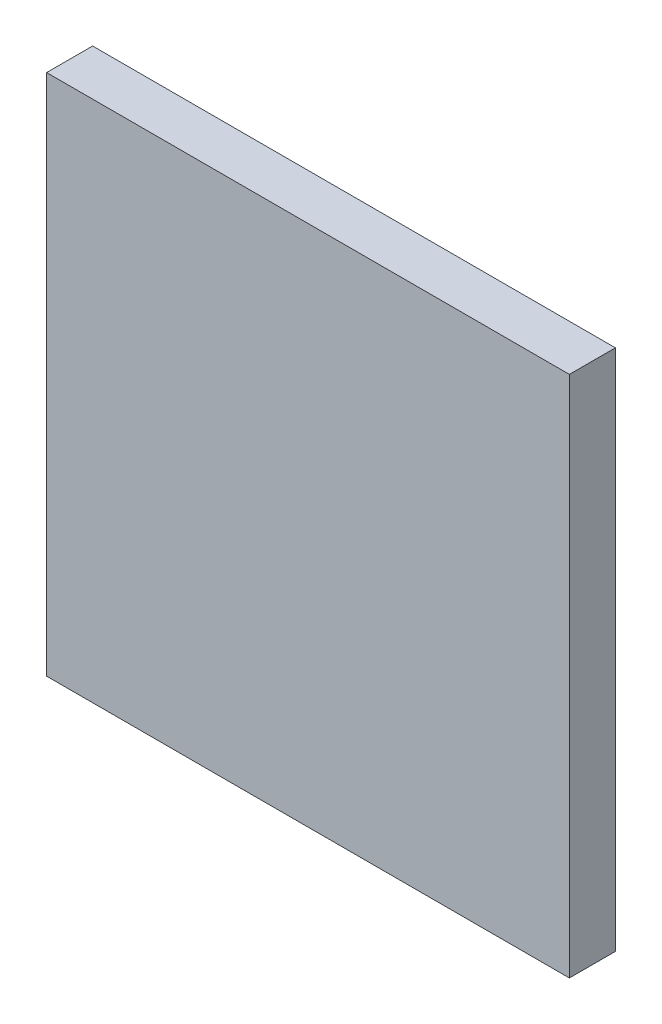
ISO-10303-21;
HEADER;
FILE_DESCRIPTION(('STEP AP214'),'2;1');
FILE_NAME('part.step','',(''),(''),'','','');
FILE_SCHEMA(('AUTOMOTIVE_DESIGN { 1 0 10303 214 1 1 1 1 }'));
ENDSEC;
DATA;
#1=APPLICATION_CONTEXT('core data for automotive mechanical design processes');
#2=APPLICATION_PROTOCOL_DEFINITION('international standard','automotive_design',2000,#1);
#3=PRODUCT_CONTEXT('',#1,'mechanical');
#4=PRODUCT('Part','Part','',(#3));
#5=PRODUCT_RELATED_PRODUCT_CATEGORY('part','',(#4));
#6=PRODUCT_DEFINITION_FORMATION('','',#4);
#7=PRODUCT_DEFINITION_CONTEXT('part definition',#1,'design');
#8=PRODUCT_DEFINITION('design','',#6,#7);
#9=PRODUCT_DEFINITION_SHAPE('','',#8);
#10=(LENGTH_UNIT() NAMED_UNIT(*) SI_UNIT(.MILLI.,.METRE.));
#11=(NAMED_UNIT(*) PLANE_ANGLE_UNIT() SI_UNIT($,.RADIAN.));
#12=(NAMED_UNIT(*) SI_UNIT($,.STERADIAN.) SOLID_ANGLE_UNIT());
#13=UNCERTAINTY_MEASURE_WITH_UNIT(LENGTH_MEASURE(1.E-05),#10,'distance_accuracy_value','');
#14=(GEOMETRIC_REPRESENTATION_CONTEXT(3) GLOBAL_UNCERTAINTY_ASSIGNED_CONTEXT((#13)) GLOBAL_UNIT_ASSIGNED_CONTEXT((#10,
#11,#12)) REPRESENTATION_CONTEXT('',''));
#15=CARTESIAN_POINT('',(0.,0.,0.));
#16=DIRECTION('',(0.,0.,1.));
#17=DIRECTION('',(1.,0.,0.));
#18=AXIS2_PLACEMENT_3D('',#15,#16,#17);
#19=CARTESIAN_POINT('',(6.25,-6.25,1.1));
#20=DIRECTION('',(-1.,0.,0.));
#21=DIRECTION('',(0.,0.,1.));
#22=AXIS2_PLACEMENT_3D('',#19,#20,#21);
#23=PLANE('',#22);
#24=DIRECTION('',(0.,1.,0.));
#25=VECTOR('',#24,1.);
#26=CARTESIAN_POINT('',(6.25,-6.25,0.));
#27=LINE('',#26,#25);
#28=CARTESIAN_POINT('',(6.25,-6.25,0.));
#29=VERTEX_POINT('',#28);
#30=CARTESIAN_POINT('',(6.25,6.25,0.));
#31=VERTEX_POINT('',#30);
#32=EDGE_CURVE('E98',#29,#31,#27,.T.);
#33=ORIENTED_EDGE('',*,*,#32,.T.);
#34=DIRECTION('',(0.,0.,-1.));
#35=VECTOR('',#34,1.);
#36=CARTESIAN_POINT('',(6.25,6.25,1.1));
#37=LINE('',#36,#35);
#38=CARTESIAN_POINT('',(6.25,6.25,1.1));
#39=VERTEX_POINT('',#38);
#40=EDGE_CURVE('E11',#39,#31,#37,.T.);
#41=ORIENTED_EDGE('',*,*,#40,.F.);
#42=DIRECTION('',(0.,1.,0.));
#43=VECTOR('',#42,1.);
#44=CARTESIAN_POINT('',(6.25,-6.25,1.1));
#45=LINE('',#44,#43);
#46=CARTESIAN_POINT('',(6.25,-6.25,1.1));
#47=VERTEX_POINT('',#46);
#48=EDGE_CURVE('E86',#47,#39,#45,.T.);
#49=ORIENTED_EDGE('',*,*,#48,.F.);
#50=DIRECTION('',(0.,0.,-1.));
#51=VECTOR('',#50,1.);
#52=CARTESIAN_POINT('',(6.25,-6.25,1.1));
#53=LINE('',#52,#51);
#54=EDGE_CURVE('E94',#47,#29,#53,.T.);
#55=ORIENTED_EDGE('',*,*,#54,.T.);
#56=EDGE_LOOP('',(#33,#41,#49,#55));
#57=FACE_BOUND('',#56,.T.);
#58=ADVANCED_FACE('F35',(#57),#23,.F.);
#59=CARTESIAN_POINT('',(-6.25,6.25,1.1));
#60=DIRECTION('',(0.,-1.,0.));
#61=DIRECTION('',(0.,0.,-1.));
#62=AXIS2_PLACEMENT_3D('',#59,#60,#61);
#63=PLANE('',#62);
#64=DIRECTION('',(-1.,0.,0.));
#65=VECTOR('',#64,1.);
#66=CARTESIAN_POINT('',(-6.25,6.25,0.));
#67=LINE('',#66,#65);
#68=CARTESIAN_POINT('',(-6.25,6.25,0.));
#69=VERTEX_POINT('',#68);
#70=EDGE_CURVE('E90',#31,#69,#67,.T.);
#71=ORIENTED_EDGE('',*,*,#70,.T.);
#72=DIRECTION('',(0.,0.,-1.));
#73=VECTOR('',#72,1.);
#74=CARTESIAN_POINT('',(-6.25,6.25,1.1));
#75=LINE('',#74,#73);
#76=CARTESIAN_POINT('',(-6.25,6.25,1.1));
#77=VERTEX_POINT('',#76);
#78=EDGE_CURVE('E43',#77,#69,#75,.T.);
#79=ORIENTED_EDGE('',*,*,#78,.F.);
#80=DIRECTION('',(-1.,0.,0.));
#81=VECTOR('',#80,1.);
#82=CARTESIAN_POINT('',(-6.25,6.25,1.1));
#83=LINE('',#82,#81);
#84=EDGE_CURVE('E81',#39,#77,#83,.T.);
#85=ORIENTED_EDGE('',*,*,#84,.F.);
#86=ORIENTED_EDGE('',*,*,#40,.T.);
#87=EDGE_LOOP('',(#71,#79,#85,#86));
#88=FACE_BOUND('',#87,.T.);
#89=ADVANCED_FACE('F89',(#88),#63,.F.);
#90=CARTESIAN_POINT('',(-6.25,-6.25,1.1));
#91=DIRECTION('',(1.,0.,0.));
#92=DIRECTION('',(0.,0.,-1.));
#93=AXIS2_PLACEMENT_3D('',#90,#91,#92);
#94=PLANE('',#93);
#95=DIRECTION('',(0.,-1.,0.));
#96=VECTOR('',#95,1.);
#97=CARTESIAN_POINT('',(-6.25,-6.25,0.));
#98=LINE('',#97,#96);
#99=CARTESIAN_POINT('',(-6.25,-6.25,0.));
#100=VERTEX_POINT('',#99);
#101=EDGE_CURVE('E68',#69,#100,#98,.T.);
#102=ORIENTED_EDGE('',*,*,#101,.T.);
#103=DIRECTION('',(0.,0.,-1.));
#104=VECTOR('',#103,1.);
#105=CARTESIAN_POINT('',(-6.25,-6.25,1.1));
#106=LINE('',#105,#104);
#107=CARTESIAN_POINT('',(-6.25,-6.25,1.1));
#108=VERTEX_POINT('',#107);
#109=EDGE_CURVE('E91',#108,#100,#106,.T.);
#110=ORIENTED_EDGE('',*,*,#109,.F.);
#111=DIRECTION('',(0.,-1.,0.));
#112=VECTOR('',#111,1.);
#113=CARTESIAN_POINT('',(-6.25,-6.25,1.1));
#114=LINE('',#113,#112);
#115=EDGE_CURVE('E84',#77,#108,#114,.T.);
#116=ORIENTED_EDGE('',*,*,#115,.F.);
#117=ORIENTED_EDGE('',*,*,#78,.T.);
#118=EDGE_LOOP('',(#102,#110,#116,#117));
#119=FACE_BOUND('',#118,.T.);
#120=ADVANCED_FACE('F92',(#119),#94,.F.);
#121=CARTESIAN_POINT('',(-6.25,-6.25,1.1));
#122=DIRECTION('',(0.,1.,0.));
#123=DIRECTION('',(0.,0.,1.));
#124=AXIS2_PLACEMENT_3D('',#121,#122,#123);
#125=PLANE('',#124);
#126=DIRECTION('',(1.,0.,0.));
#127=VECTOR('',#126,1.);
#128=CARTESIAN_POINT('',(-6.25,-6.25,0.));
#129=LINE('',#128,#127);
#130=EDGE_CURVE('E74',#100,#29,#129,.T.);
#131=ORIENTED_EDGE('',*,*,#130,.T.);
#132=ORIENTED_EDGE('',*,*,#54,.F.);
#133=DIRECTION('',(1.,0.,0.));
#134=VECTOR('',#133,1.);
#135=CARTESIAN_POINT('',(-6.25,-6.25,1.1));
#136=LINE('',#135,#134);
#137=EDGE_CURVE('E51',#108,#47,#136,.T.);
#138=ORIENTED_EDGE('',*,*,#137,.F.);
#139=ORIENTED_EDGE('',*,*,#109,.T.);
#140=EDGE_LOOP('',(#131,#132,#138,#139));
#141=FACE_BOUND('',#140,.T.);
#142=ADVANCED_FACE('F105',(#141),#125,.F.);
#143=CARTESIAN_POINT('',(0.,0.,1.1));
#144=DIRECTION('',(0.,0.,-1.));
#145=DIRECTION('',(-1.,0.,0.));
#146=AXIS2_PLACEMENT_3D('',#143,#144,#145);
#147=PLANE('',#146);
#148=ORIENTED_EDGE('',*,*,#48,.T.);
#149=ORIENTED_EDGE('',*,*,#84,.T.);
#150=ORIENTED_EDGE('',*,*,#115,.T.);
#151=ORIENTED_EDGE('',*,*,#137,.T.);
#152=EDGE_LOOP('',(#148,#149,#150,#151));
#153=FACE_BOUND('',#152,.T.);
#154=ADVANCED_FACE('F82',(#153),#147,.F.);
#155=CARTESIAN_POINT('',(0.,0.,0.));
#156=DIRECTION('',(0.,0.,-1.));
#157=DIRECTION('',(-1.,0.,0.));
#158=AXIS2_PLACEMENT_3D('',#155,#156,#157);
#159=PLANE('',#158);
#160=ORIENTED_EDGE('',*,*,#32,.F.);
#161=ORIENTED_EDGE('',*,*,#130,.F.);
#162=ORIENTED_EDGE('',*,*,#101,.F.);
#163=ORIENTED_EDGE('',*,*,#70,.F.);
#164=EDGE_LOOP('',(#160,#161,#162,#163));
#165=FACE_BOUND('',#164,.T.);
#166=ADVANCED_FACE('F108',(#165),#159,.T.);
#167=CLOSED_SHELL('',(#58,#89,#120,#142,#154,#166));
#168=MANIFOLD_SOLID_BREP('B2',#167);
#169=ADVANCED_BREP_SHAPE_REPRESENTATION('',(#18,#168),#14);
#170=SHAPE_DEFINITION_REPRESENTATION(#9,#169);
ENDSEC;
END-ISO-10303-21;
